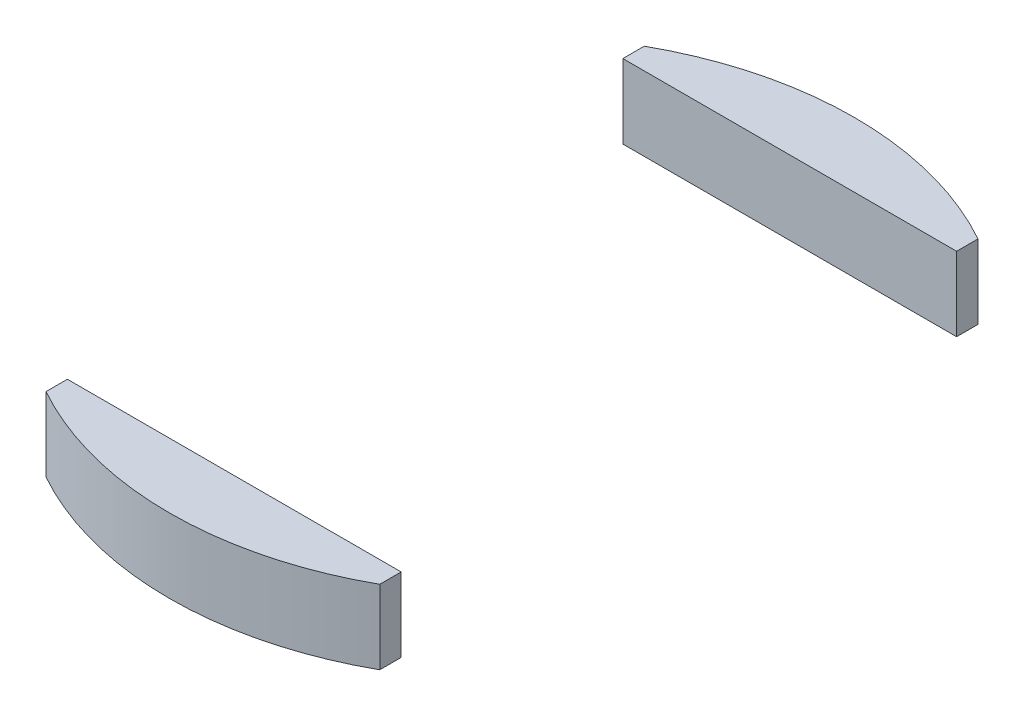
ISO-10303-21;
HEADER;
FILE_DESCRIPTION(('STEP AP214'),'2;1');
FILE_NAME('part.step','',(''),(''),'','','');
FILE_SCHEMA(('AUTOMOTIVE_DESIGN { 1 0 10303 214 1 1 1 1 }'));
ENDSEC;
DATA;
#1=APPLICATION_CONTEXT('core data for automotive mechanical design processes');
#2=APPLICATION_PROTOCOL_DEFINITION('international standard','automotive_design',2000,#1);
#3=PRODUCT_CONTEXT('',#1,'mechanical');
#4=PRODUCT('Part','Part','',(#3));
#5=PRODUCT_RELATED_PRODUCT_CATEGORY('part','',(#4));
#6=PRODUCT_DEFINITION_FORMATION('','',#4);
#7=PRODUCT_DEFINITION_CONTEXT('part definition',#1,'design');
#8=PRODUCT_DEFINITION('design','',#6,#7);
#9=PRODUCT_DEFINITION_SHAPE('','',#8);
#10=(LENGTH_UNIT() NAMED_UNIT(*) SI_UNIT(.MILLI.,.METRE.));
#11=(NAMED_UNIT(*) PLANE_ANGLE_UNIT() SI_UNIT($,.RADIAN.));
#12=(NAMED_UNIT(*) SI_UNIT($,.STERADIAN.) SOLID_ANGLE_UNIT());
#13=UNCERTAINTY_MEASURE_WITH_UNIT(LENGTH_MEASURE(1.E-05),#10,'distance_accuracy_value','');
#14=(GEOMETRIC_REPRESENTATION_CONTEXT(3) GLOBAL_UNCERTAINTY_ASSIGNED_CONTEXT((#13)) GLOBAL_UNIT_ASSIGNED_CONTEXT((#10,
#11,#12)) REPRESENTATION_CONTEXT('',''));
#15=CARTESIAN_POINT('',(0.,0.,0.));
#16=DIRECTION('',(0.,0.,1.));
#17=DIRECTION('',(1.,0.,0.));
#18=AXIS2_PLACEMENT_3D('',#15,#16,#17);
#19=CARTESIAN_POINT('',(0.,4.,15.));
#20=DIRECTION('',(0.,0.,-1.));
#21=DIRECTION('',(-1.,0.,0.));
#22=AXIS2_PLACEMENT_3D('',#19,#20,#21);
#23=PLANE('',#22);
#24=DIRECTION('',(1.,0.,0.));
#25=VECTOR('',#24,1.);
#26=CARTESIAN_POINT('',(0.,0.,15.));
#27=LINE('',#26,#25);
#28=CARTESIAN_POINT('',(-9.01387818865997,0.,15.));
#29=VERTEX_POINT('',#28);
#30=CARTESIAN_POINT('',(9.01387818865997,0.,15.));
#31=VERTEX_POINT('',#30);
#32=EDGE_CURVE('E118',#29,#31,#27,.T.);
#33=ORIENTED_EDGE('',*,*,#32,.F.);
#34=DIRECTION('',(0.,-1.,0.));
#35=VECTOR('',#34,1.);
#36=CARTESIAN_POINT('',(-9.01387818865997,4.,15.));
#37=LINE('',#36,#35);
#38=CARTESIAN_POINT('',(-9.01387818865997,4.,15.));
#39=VERTEX_POINT('',#38);
#40=EDGE_CURVE('E12',#39,#29,#37,.T.);
#41=ORIENTED_EDGE('',*,*,#40,.F.);
#42=DIRECTION('',(1.,0.,0.));
#43=VECTOR('',#42,1.);
#44=CARTESIAN_POINT('',(0.,4.,15.));
#45=LINE('',#44,#43);
#46=CARTESIAN_POINT('',(9.01387818865997,4.,15.));
#47=VERTEX_POINT('',#46);
#48=EDGE_CURVE('E103',#39,#47,#45,.T.);
#49=ORIENTED_EDGE('',*,*,#48,.T.);
#50=DIRECTION('',(0.,-1.,0.));
#51=VECTOR('',#50,1.);
#52=CARTESIAN_POINT('',(9.01387818865997,4.,15.));
#53=LINE('',#52,#51);
#54=EDGE_CURVE('E71',#47,#31,#53,.T.);
#55=ORIENTED_EDGE('',*,*,#54,.T.);
#56=EDGE_LOOP('',(#33,#41,#49,#55));
#57=FACE_BOUND('',#56,.T.);
#58=ADVANCED_FACE('F55',(#57),#23,.T.);
#59=CARTESIAN_POINT('',(-9.01387818865997,4.,0.));
#60=DIRECTION('',(1.,0.,0.));
#61=DIRECTION('',(0.,0.,-1.));
#62=AXIS2_PLACEMENT_3D('',#59,#60,#61);
#63=PLANE('',#62);
#64=DIRECTION('',(0.,0.,1.));
#65=VECTOR('',#64,1.);
#66=CARTESIAN_POINT('',(-9.01387818865997,0.,0.));
#67=LINE('',#66,#65);
#68=CARTESIAN_POINT('',(-9.01387818865997,0.,16.1554944214035));
#69=VERTEX_POINT('',#68);
#70=EDGE_CURVE('E109',#29,#69,#67,.T.);
#71=ORIENTED_EDGE('',*,*,#70,.T.);
#72=DIRECTION('',(0.,-1.,0.));
#73=VECTOR('',#72,1.);
#74=CARTESIAN_POINT('',(-9.01387818865997,4.,16.1554944214035));
#75=LINE('',#74,#73);
#76=CARTESIAN_POINT('',(-9.01387818865997,4.,16.1554944214035));
#77=VERTEX_POINT('',#76);
#78=EDGE_CURVE('E63',#77,#69,#75,.T.);
#79=ORIENTED_EDGE('',*,*,#78,.F.);
#80=DIRECTION('',(0.,0.,1.));
#81=VECTOR('',#80,1.);
#82=CARTESIAN_POINT('',(-9.01387818865997,4.,0.));
#83=LINE('',#82,#81);
#84=EDGE_CURVE('E97',#39,#77,#83,.T.);
#85=ORIENTED_EDGE('',*,*,#84,.F.);
#86=ORIENTED_EDGE('',*,*,#40,.T.);
#87=EDGE_LOOP('',(#71,#79,#85,#86));
#88=FACE_BOUND('',#87,.T.);
#89=ADVANCED_FACE('F107',(#88),#63,.F.);
#90=CARTESIAN_POINT('',(0.,4.,0.));
#91=DIRECTION('',(0.,-1.,0.));
#92=DIRECTION('',(0.,0.,-1.));
#93=AXIS2_PLACEMENT_3D('',#90,#91,#92);
#94=CYLINDRICAL_SURFACE('',#93,18.5);
#95=CARTESIAN_POINT('',(0.,0.,0.));
#96=DIRECTION('',(0.,1.,0.));
#97=DIRECTION('',(0.,0.,1.));
#98=AXIS2_PLACEMENT_3D('',#95,#96,#97);
#99=CIRCLE('',#98,18.5);
#100=CARTESIAN_POINT('',(9.01387818865997,0.,16.1554944214035));
#101=VERTEX_POINT('',#100);
#102=EDGE_CURVE('E121',#69,#101,#99,.T.);
#103=ORIENTED_EDGE('',*,*,#102,.T.);
#104=DIRECTION('',(0.,-1.,0.));
#105=VECTOR('',#104,1.);
#106=CARTESIAN_POINT('',(9.01387818865997,4.,16.1554944214035));
#107=LINE('',#106,#105);
#108=CARTESIAN_POINT('',(9.01387818865997,4.,16.1554944214035));
#109=VERTEX_POINT('',#108);
#110=EDGE_CURVE('E85',#109,#101,#107,.T.);
#111=ORIENTED_EDGE('',*,*,#110,.F.);
#112=CARTESIAN_POINT('',(0.,4.,0.));
#113=DIRECTION('',(0.,1.,0.));
#114=DIRECTION('',(0.,0.,1.));
#115=AXIS2_PLACEMENT_3D('',#112,#113,#114);
#116=CIRCLE('',#115,18.5);
#117=EDGE_CURVE('E102',#77,#109,#116,.T.);
#118=ORIENTED_EDGE('',*,*,#117,.F.);
#119=ORIENTED_EDGE('',*,*,#78,.T.);
#120=EDGE_LOOP('',(#103,#111,#118,#119));
#121=FACE_BOUND('',#120,.T.);
#122=ADVANCED_FACE('F112',(#121),#94,.T.);
#123=CARTESIAN_POINT('',(9.01387818865997,4.,0.));
#124=DIRECTION('',(1.,0.,0.));
#125=DIRECTION('',(0.,0.,-1.));
#126=AXIS2_PLACEMENT_3D('',#123,#124,#125);
#127=PLANE('',#126);
#128=DIRECTION('',(0.,0.,1.));
#129=VECTOR('',#128,1.);
#130=CARTESIAN_POINT('',(9.01387818865997,0.,0.));
#131=LINE('',#130,#129);
#132=EDGE_CURVE('E123',#31,#101,#131,.T.);
#133=ORIENTED_EDGE('',*,*,#132,.F.);
#134=ORIENTED_EDGE('',*,*,#54,.F.);
#135=DIRECTION('',(0.,0.,1.));
#136=VECTOR('',#135,1.);
#137=CARTESIAN_POINT('',(9.01387818865997,4.,0.));
#138=LINE('',#137,#136);
#139=EDGE_CURVE('E113',#47,#109,#138,.T.);
#140=ORIENTED_EDGE('',*,*,#139,.T.);
#141=ORIENTED_EDGE('',*,*,#110,.T.);
#142=EDGE_LOOP('',(#133,#134,#140,#141));
#143=FACE_BOUND('',#142,.T.);
#144=ADVANCED_FACE('F128',(#143),#127,.T.);
#145=CARTESIAN_POINT('',(0.,4.,0.));
#146=DIRECTION('',(0.,1.,0.));
#147=DIRECTION('',(0.,0.,1.));
#148=AXIS2_PLACEMENT_3D('',#145,#146,#147);
#149=PLANE('',#148);
#150=ORIENTED_EDGE('',*,*,#48,.F.);
#151=ORIENTED_EDGE('',*,*,#84,.T.);
#152=ORIENTED_EDGE('',*,*,#117,.T.);
#153=ORIENTED_EDGE('',*,*,#139,.F.);
#154=EDGE_LOOP('',(#150,#151,#152,#153));
#155=FACE_BOUND('',#154,.T.);
#156=ADVANCED_FACE('F99',(#155),#149,.T.);
#157=CARTESIAN_POINT('',(0.,0.,0.));
#158=DIRECTION('',(0.,1.,0.));
#159=DIRECTION('',(0.,0.,1.));
#160=AXIS2_PLACEMENT_3D('',#157,#158,#159);
#161=PLANE('',#160);
#162=ORIENTED_EDGE('',*,*,#32,.T.);
#163=ORIENTED_EDGE('',*,*,#132,.T.);
#164=ORIENTED_EDGE('',*,*,#102,.F.);
#165=ORIENTED_EDGE('',*,*,#70,.F.);
#166=EDGE_LOOP('',(#162,#163,#164,#165));
#167=FACE_BOUND('',#166,.T.);
#168=ADVANCED_FACE('F135',(#167),#161,.F.);
#169=CLOSED_SHELL('',(#58,#89,#122,#144,#156,#168));
#170=MANIFOLD_SOLID_BREP('B2',#169);
#171=CARTESIAN_POINT('',(0.,4.,-15.));
#172=DIRECTION('',(0.,0.,-1.));
#173=DIRECTION('',(-1.,0.,0.));
#174=AXIS2_PLACEMENT_3D('',#171,#172,#173);
#175=PLANE('',#174);
#176=DIRECTION('',(1.,0.,0.));
#177=VECTOR('',#176,1.);
#178=CARTESIAN_POINT('',(0.,0.,-15.));
#179=LINE('',#178,#177);
#180=CARTESIAN_POINT('',(-9.01387818865997,0.,-15.));
#181=VERTEX_POINT('',#180);
#182=CARTESIAN_POINT('',(9.01387818865997,0.,-15.));
#183=VERTEX_POINT('',#182);
#184=EDGE_CURVE('E253',#181,#183,#179,.T.);
#185=ORIENTED_EDGE('',*,*,#184,.T.);
#186=DIRECTION('',(0.,-1.,0.));
#187=VECTOR('',#186,1.);
#188=CARTESIAN_POINT('',(9.01387818865997,4.,-15.));
#189=LINE('',#188,#187);
#190=CARTESIAN_POINT('',(9.01387818865997,4.,-15.));
#191=VERTEX_POINT('',#190);
#192=EDGE_CURVE('E53',#191,#183,#189,.T.);
#193=ORIENTED_EDGE('',*,*,#192,.F.);
#194=DIRECTION('',(1.,0.,0.));
#195=VECTOR('',#194,1.);
#196=CARTESIAN_POINT('',(0.,4.,-15.));
#197=LINE('',#196,#195);
#198=CARTESIAN_POINT('',(-9.01387818865997,4.,-15.));
#199=VERTEX_POINT('',#198);
#200=EDGE_CURVE('E235',#199,#191,#197,.T.);
#201=ORIENTED_EDGE('',*,*,#200,.F.);
#202=DIRECTION('',(0.,-1.,0.));
#203=VECTOR('',#202,1.);
#204=CARTESIAN_POINT('',(-9.01387818865997,4.,-15.));
#205=LINE('',#204,#203);
#206=EDGE_CURVE('E202',#199,#181,#205,.T.);
#207=ORIENTED_EDGE('',*,*,#206,.T.);
#208=EDGE_LOOP('',(#185,#193,#201,#207));
#209=FACE_BOUND('',#208,.T.);
#210=ADVANCED_FACE('F185',(#209),#175,.F.);
#211=CARTESIAN_POINT('',(9.01387818865997,4.,0.));
#212=DIRECTION('',(-1.,0.,0.));
#213=DIRECTION('',(0.,0.,1.));
#214=AXIS2_PLACEMENT_3D('',#211,#212,#213);
#215=PLANE('',#214);
#216=DIRECTION('',(0.,0.,-1.));
#217=VECTOR('',#216,1.);
#218=CARTESIAN_POINT('',(9.01387818865997,0.,0.));
#219=LINE('',#218,#217);
#220=CARTESIAN_POINT('',(9.01387818865997,0.,-16.1554944214035));
#221=VERTEX_POINT('',#220);
#222=EDGE_CURVE('E241',#183,#221,#219,.T.);
#223=ORIENTED_EDGE('',*,*,#222,.T.);
#224=DIRECTION('',(0.,-1.,0.));
#225=VECTOR('',#224,1.);
#226=CARTESIAN_POINT('',(9.01387818865997,4.,-16.1554944214035));
#227=LINE('',#226,#225);
#228=CARTESIAN_POINT('',(9.01387818865997,4.,-16.1554944214035));
#229=VERTEX_POINT('',#228);
#230=EDGE_CURVE('E194',#229,#221,#227,.T.);
#231=ORIENTED_EDGE('',*,*,#230,.F.);
#232=DIRECTION('',(0.,0.,-1.));
#233=VECTOR('',#232,1.);
#234=CARTESIAN_POINT('',(9.01387818865997,4.,0.));
#235=LINE('',#234,#233);
#236=EDGE_CURVE('E228',#191,#229,#235,.T.);
#237=ORIENTED_EDGE('',*,*,#236,.F.);
#238=ORIENTED_EDGE('',*,*,#192,.T.);
#239=EDGE_LOOP('',(#223,#231,#237,#238));
#240=FACE_BOUND('',#239,.T.);
#241=ADVANCED_FACE('F240',(#240),#215,.F.);
#242=CARTESIAN_POINT('',(0.,4.,0.));
#243=DIRECTION('',(0.,-1.,0.));
#244=DIRECTION('',(0.,0.,-1.));
#245=AXIS2_PLACEMENT_3D('',#242,#243,#244);
#246=CYLINDRICAL_SURFACE('',#245,18.5);
#247=CARTESIAN_POINT('',(0.,0.,0.));
#248=DIRECTION('',(0.,1.,0.));
#249=DIRECTION('',(0.,0.,1.));
#250=AXIS2_PLACEMENT_3D('',#247,#248,#249);
#251=CIRCLE('',#250,18.5);
#252=CARTESIAN_POINT('',(-9.01387818865997,0.,-16.1554944214035));
#253=VERTEX_POINT('',#252);
#254=EDGE_CURVE('E258',#221,#253,#251,.T.);
#255=ORIENTED_EDGE('',*,*,#254,.T.);
#256=DIRECTION('',(0.,-1.,0.));
#257=VECTOR('',#256,1.);
#258=CARTESIAN_POINT('',(-9.01387818865997,4.,-16.1554944214035));
#259=LINE('',#258,#257);
#260=CARTESIAN_POINT('',(-9.01387818865997,4.,-16.1554944214035));
#261=VERTEX_POINT('',#260);
#262=EDGE_CURVE('E217',#261,#253,#259,.T.);
#263=ORIENTED_EDGE('',*,*,#262,.F.);
#264=CARTESIAN_POINT('',(0.,4.,0.));
#265=DIRECTION('',(0.,1.,0.));
#266=DIRECTION('',(0.,0.,1.));
#267=AXIS2_PLACEMENT_3D('',#264,#265,#266);
#268=CIRCLE('',#267,18.5);
#269=EDGE_CURVE('E234',#229,#261,#268,.T.);
#270=ORIENTED_EDGE('',*,*,#269,.F.);
#271=ORIENTED_EDGE('',*,*,#230,.T.);
#272=EDGE_LOOP('',(#255,#263,#270,#271));
#273=FACE_BOUND('',#272,.T.);
#274=ADVANCED_FACE('F245',(#273),#246,.T.);
#275=CARTESIAN_POINT('',(-9.01387818865997,4.,0.));
#276=DIRECTION('',(-1.,0.,0.));
#277=DIRECTION('',(0.,0.,1.));
#278=AXIS2_PLACEMENT_3D('',#275,#276,#277);
#279=PLANE('',#278);
#280=DIRECTION('',(0.,0.,-1.));
#281=VECTOR('',#280,1.);
#282=CARTESIAN_POINT('',(-9.01387818865997,0.,0.));
#283=LINE('',#282,#281);
#284=EDGE_CURVE('E261',#181,#253,#283,.T.);
#285=ORIENTED_EDGE('',*,*,#284,.F.);
#286=ORIENTED_EDGE('',*,*,#206,.F.);
#287=DIRECTION('',(0.,0.,-1.));
#288=VECTOR('',#287,1.);
#289=CARTESIAN_POINT('',(-9.01387818865997,4.,0.));
#290=LINE('',#289,#288);
#291=EDGE_CURVE('E247',#199,#261,#290,.T.);
#292=ORIENTED_EDGE('',*,*,#291,.T.);
#293=ORIENTED_EDGE('',*,*,#262,.T.);
#294=EDGE_LOOP('',(#285,#286,#292,#293));
#295=FACE_BOUND('',#294,.T.);
#296=ADVANCED_FACE('F271',(#295),#279,.T.);
#297=CARTESIAN_POINT('',(0.,4.,0.));
#298=DIRECTION('',(0.,1.,0.));
#299=DIRECTION('',(0.,0.,1.));
#300=AXIS2_PLACEMENT_3D('',#297,#298,#299);
#301=PLANE('',#300);
#302=ORIENTED_EDGE('',*,*,#200,.T.);
#303=ORIENTED_EDGE('',*,*,#236,.T.);
#304=ORIENTED_EDGE('',*,*,#269,.T.);
#305=ORIENTED_EDGE('',*,*,#291,.F.);
#306=EDGE_LOOP('',(#302,#303,#304,#305));
#307=FACE_BOUND('',#306,.T.);
#308=ADVANCED_FACE('F231',(#307),#301,.T.);
#309=CARTESIAN_POINT('',(0.,0.,0.));
#310=DIRECTION('',(0.,1.,0.));
#311=DIRECTION('',(0.,0.,1.));
#312=AXIS2_PLACEMENT_3D('',#309,#310,#311);
#313=PLANE('',#312);
#314=ORIENTED_EDGE('',*,*,#184,.F.);
#315=ORIENTED_EDGE('',*,*,#284,.T.);
#316=ORIENTED_EDGE('',*,*,#254,.F.);
#317=ORIENTED_EDGE('',*,*,#222,.F.);
#318=EDGE_LOOP('',(#314,#315,#316,#317));
#319=FACE_BOUND('',#318,.T.);
#320=ADVANCED_FACE('F270',(#319),#313,.F.);
#321=CLOSED_SHELL('',(#210,#241,#274,#296,#308,#320));
#322=MANIFOLD_SOLID_BREP('B6',#321);
#323=ADVANCED_BREP_SHAPE_REPRESENTATION('',(#18,#170,#322),#14);
#324=SHAPE_DEFINITION_REPRESENTATION(#9,#323);
ENDSEC;
END-ISO-10303-21;
